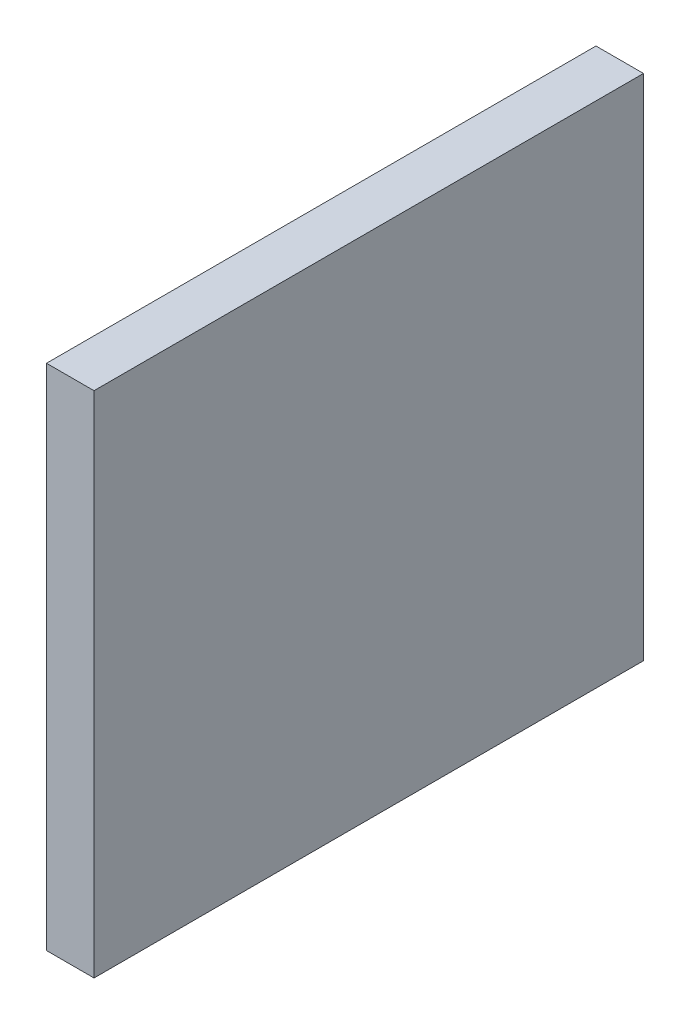
ISO-10303-21;
HEADER;
FILE_DESCRIPTION(('STEP AP214'),'2;1');
FILE_NAME('part.step','',(''),(''),'','','');
FILE_SCHEMA(('AUTOMOTIVE_DESIGN { 1 0 10303 214 1 1 1 1 }'));
ENDSEC;
DATA;
#1=APPLICATION_CONTEXT('core data for automotive mechanical design processes');
#2=APPLICATION_PROTOCOL_DEFINITION('international standard','automotive_design',2000,#1);
#3=PRODUCT_CONTEXT('',#1,'mechanical');
#4=PRODUCT('Part','Part','',(#3));
#5=PRODUCT_RELATED_PRODUCT_CATEGORY('part','',(#4));
#6=PRODUCT_DEFINITION_FORMATION('','',#4);
#7=PRODUCT_DEFINITION_CONTEXT('part definition',#1,'design');
#8=PRODUCT_DEFINITION('design','',#6,#7);
#9=PRODUCT_DEFINITION_SHAPE('','',#8);
#10=(LENGTH_UNIT() NAMED_UNIT(*) SI_UNIT(.MILLI.,.METRE.));
#11=(NAMED_UNIT(*) PLANE_ANGLE_UNIT() SI_UNIT($,.RADIAN.));
#12=(NAMED_UNIT(*) SI_UNIT($,.STERADIAN.) SOLID_ANGLE_UNIT());
#13=UNCERTAINTY_MEASURE_WITH_UNIT(LENGTH_MEASURE(1.E-05),#10,'distance_accuracy_value','');
#14=(GEOMETRIC_REPRESENTATION_CONTEXT(3) GLOBAL_UNCERTAINTY_ASSIGNED_CONTEXT((#13)) GLOBAL_UNIT_ASSIGNED_CONTEXT((#10,
#11,#12)) REPRESENTATION_CONTEXT('',''));
#15=CARTESIAN_POINT('',(0.,0.,0.));
#16=DIRECTION('',(0.,0.,1.));
#17=DIRECTION('',(1.,0.,0.));
#18=AXIS2_PLACEMENT_3D('',#15,#16,#17);
#19=CARTESIAN_POINT('',(-113.6,0.,-220.264426124934));
#20=DIRECTION('',(-1.,0.,0.));
#21=DIRECTION('',(0.,-1.,0.));
#22=AXIS2_PLACEMENT_3D('',#19,#20,#21);
#23=PLANE('',#22);
#24=DIRECTION('',(0.,1.,0.));
#25=VECTOR('',#24,1.);
#26=CARTESIAN_POINT('',(-113.6,0.,-274.));
#27=LINE('',#26,#25);
#28=CARTESIAN_POINT('',(-113.6,-53.5024476045967,-274.));
#29=VERTEX_POINT('',#28);
#30=CARTESIAN_POINT('',(-113.6,0.,-274.));
#31=VERTEX_POINT('',#30);
#32=EDGE_CURVE('E85',#29,#31,#27,.T.);
#33=ORIENTED_EDGE('',*,*,#32,.F.);
#34=DIRECTION('',(0.,0.,-1.));
#35=VECTOR('',#34,1.);
#36=CARTESIAN_POINT('',(-113.6,-53.5024476045967,-220.264426124934));
#37=LINE('',#36,#35);
#38=CARTESIAN_POINT('',(-113.6,-53.5024476045967,-331.8));
#39=VERTEX_POINT('',#38);
#40=EDGE_CURVE('E39',#29,#39,#37,.T.);
#41=ORIENTED_EDGE('',*,*,#40,.T.);
#42=DIRECTION('',(0.,1.,0.));
#43=VECTOR('',#42,1.);
#44=CARTESIAN_POINT('',(-113.6,0.,-331.8));
#45=LINE('',#44,#43);
#46=CARTESIAN_POINT('',(-113.6,0.,-331.8));
#47=VERTEX_POINT('',#46);
#48=EDGE_CURVE('E83',#39,#47,#45,.T.);
#49=ORIENTED_EDGE('',*,*,#48,.T.);
#50=DIRECTION('',(0.,0.,-1.));
#51=VECTOR('',#50,1.);
#52=CARTESIAN_POINT('',(-113.6,0.,-220.264426124934));
#53=LINE('',#52,#51);
#54=EDGE_CURVE('E74',#31,#47,#53,.T.);
#55=ORIENTED_EDGE('',*,*,#54,.F.);
#56=EDGE_LOOP('',(#33,#41,#49,#55));
#57=FACE_BOUND('',#56,.T.);
#58=ADVANCED_FACE('F35',(#57),#23,.F.);
#59=CARTESIAN_POINT('',(-113.6,0.,-220.264426124934));
#60=DIRECTION('',(0.,-1.,0.));
#61=DIRECTION('',(0.,0.,-1.));
#62=AXIS2_PLACEMENT_3D('',#59,#60,#61);
#63=PLANE('',#62);
#64=DIRECTION('',(-1.,0.,0.));
#65=VECTOR('',#64,1.);
#66=CARTESIAN_POINT('',(-249.6,-8.88178419700125E-13,-274.));
#67=LINE('',#66,#65);
#68=CARTESIAN_POINT('',(-118.6,0.,-274.));
#69=VERTEX_POINT('',#68);
#70=EDGE_CURVE('E44',#31,#69,#67,.T.);
#71=ORIENTED_EDGE('',*,*,#70,.F.);
#72=ORIENTED_EDGE('',*,*,#54,.T.);
#73=DIRECTION('',(-1.,0.,0.));
#74=VECTOR('',#73,1.);
#75=CARTESIAN_POINT('',(-113.6,0.,-331.8));
#76=LINE('',#75,#74);
#77=CARTESIAN_POINT('',(-118.6,0.,-331.8));
#78=VERTEX_POINT('',#77);
#79=EDGE_CURVE('E95',#47,#78,#76,.T.);
#80=ORIENTED_EDGE('',*,*,#79,.T.);
#81=DIRECTION('',(0.,0.,-1.));
#82=VECTOR('',#81,1.);
#83=CARTESIAN_POINT('',(-118.6,0.,-220.264426124934));
#84=LINE('',#83,#82);
#85=EDGE_CURVE('E104',#69,#78,#84,.T.);
#86=ORIENTED_EDGE('',*,*,#85,.F.);
#87=EDGE_LOOP('',(#71,#72,#80,#86));
#88=FACE_BOUND('',#87,.T.);
#89=ADVANCED_FACE('F108',(#88),#63,.F.);
#90=CARTESIAN_POINT('',(-118.6,0.,-220.264426124934));
#91=DIRECTION('',(1.,0.,0.));
#92=DIRECTION('',(0.,1.,0.));
#93=AXIS2_PLACEMENT_3D('',#90,#91,#92);
#94=PLANE('',#93);
#95=DIRECTION('',(0.,-1.,0.));
#96=VECTOR('',#95,1.);
#97=CARTESIAN_POINT('',(-118.6,0.,-274.));
#98=LINE('',#97,#96);
#99=CARTESIAN_POINT('',(-118.6,-53.5024476045967,-274.));
#100=VERTEX_POINT('',#99);
#101=EDGE_CURVE('E11',#69,#100,#98,.T.);
#102=ORIENTED_EDGE('',*,*,#101,.F.);
#103=ORIENTED_EDGE('',*,*,#85,.T.);
#104=DIRECTION('',(0.,-1.,0.));
#105=VECTOR('',#104,1.);
#106=CARTESIAN_POINT('',(-118.6,0.,-331.8));
#107=LINE('',#106,#105);
#108=CARTESIAN_POINT('',(-118.6,-53.5024476045967,-331.8));
#109=VERTEX_POINT('',#108);
#110=EDGE_CURVE('E105',#78,#109,#107,.T.);
#111=ORIENTED_EDGE('',*,*,#110,.T.);
#112=DIRECTION('',(0.,0.,-1.));
#113=VECTOR('',#112,1.);
#114=CARTESIAN_POINT('',(-118.6,-53.5024476045967,-220.264426124934));
#115=LINE('',#114,#113);
#116=EDGE_CURVE('E57',#100,#109,#115,.T.);
#117=ORIENTED_EDGE('',*,*,#116,.F.);
#118=EDGE_LOOP('',(#102,#103,#111,#117));
#119=FACE_BOUND('',#118,.T.);
#120=ADVANCED_FACE('F107',(#119),#94,.F.);
#121=CARTESIAN_POINT('',(-113.6,-53.5024476045967,-220.264426124934));
#122=DIRECTION('',(0.,1.,0.));
#123=DIRECTION('',(0.,0.,1.));
#124=AXIS2_PLACEMENT_3D('',#121,#122,#123);
#125=PLANE('',#124);
#126=DIRECTION('',(1.,0.,0.));
#127=VECTOR('',#126,1.);
#128=CARTESIAN_POINT('',(-113.6,-53.5024476045967,-274.));
#129=LINE('',#128,#127);
#130=EDGE_CURVE('E92',#100,#29,#129,.T.);
#131=ORIENTED_EDGE('',*,*,#130,.F.);
#132=ORIENTED_EDGE('',*,*,#116,.T.);
#133=DIRECTION('',(1.,0.,0.));
#134=VECTOR('',#133,1.);
#135=CARTESIAN_POINT('',(-113.6,-53.5024476045967,-331.8));
#136=LINE('',#135,#134);
#137=EDGE_CURVE('E88',#109,#39,#136,.T.);
#138=ORIENTED_EDGE('',*,*,#137,.T.);
#139=ORIENTED_EDGE('',*,*,#40,.F.);
#140=EDGE_LOOP('',(#131,#132,#138,#139));
#141=FACE_BOUND('',#140,.T.);
#142=ADVANCED_FACE('F89',(#141),#125,.F.);
#143=CARTESIAN_POINT('',(0.,0.,-331.8));
#144=DIRECTION('',(0.,0.,-1.));
#145=DIRECTION('',(-1.,0.,0.));
#146=AXIS2_PLACEMENT_3D('',#143,#144,#145);
#147=PLANE('',#146);
#148=ORIENTED_EDGE('',*,*,#48,.F.);
#149=ORIENTED_EDGE('',*,*,#137,.F.);
#150=ORIENTED_EDGE('',*,*,#110,.F.);
#151=ORIENTED_EDGE('',*,*,#79,.F.);
#152=EDGE_LOOP('',(#148,#149,#150,#151));
#153=FACE_BOUND('',#152,.T.);
#154=ADVANCED_FACE('F94',(#153),#147,.T.);
#155=CARTESIAN_POINT('',(3146.00000000005,69.0000000000213,-274.));
#156=DIRECTION('',(0.,0.,1.));
#157=DIRECTION('',(1.,0.,0.));
#158=AXIS2_PLACEMENT_3D('',#155,#156,#157);
#159=PLANE('',#158);
#160=ORIENTED_EDGE('',*,*,#130,.T.);
#161=ORIENTED_EDGE('',*,*,#32,.T.);
#162=ORIENTED_EDGE('',*,*,#70,.T.);
#163=ORIENTED_EDGE('',*,*,#101,.T.);
#164=EDGE_LOOP('',(#160,#161,#162,#163));
#165=FACE_BOUND('',#164,.T.);
#166=ADVANCED_FACE('F37',(#165),#159,.T.);
#167=CLOSED_SHELL('',(#58,#89,#120,#142,#154,#166));
#168=MANIFOLD_SOLID_BREP('B2',#167);
#169=ADVANCED_BREP_SHAPE_REPRESENTATION('',(#18,#168),#14);
#170=SHAPE_DEFINITION_REPRESENTATION(#9,#169);
ENDSEC;
END-ISO-10303-21;
